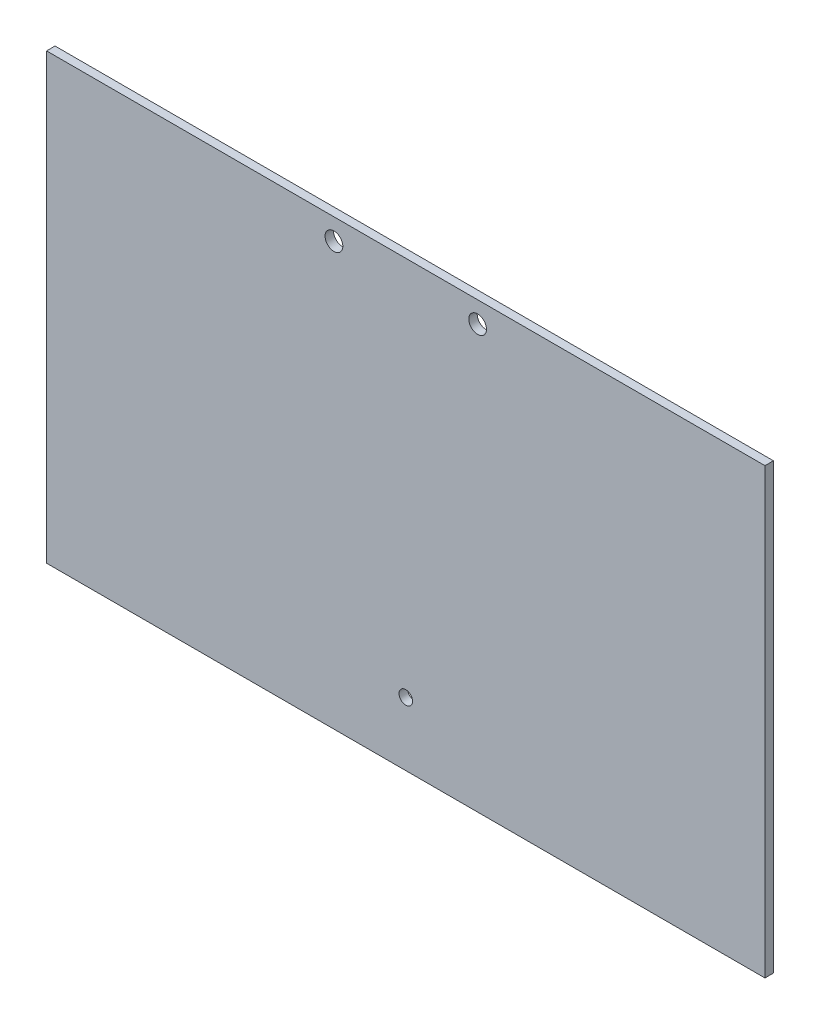
ISO-10303-21;
HEADER;
FILE_DESCRIPTION(('STEP AP214'),'2;1');
FILE_NAME('part.step','',(''),(''),'','','');
FILE_SCHEMA(('AUTOMOTIVE_DESIGN { 1 0 10303 214 1 1 1 1 }'));
ENDSEC;
DATA;
#1=APPLICATION_CONTEXT('core data for automotive mechanical design processes');
#2=APPLICATION_PROTOCOL_DEFINITION('international standard','automotive_design',2000,#1);
#3=PRODUCT_CONTEXT('',#1,'mechanical');
#4=PRODUCT('Part','Part','',(#3));
#5=PRODUCT_RELATED_PRODUCT_CATEGORY('part','',(#4));
#6=PRODUCT_DEFINITION_FORMATION('','',#4);
#7=PRODUCT_DEFINITION_CONTEXT('part definition',#1,'design');
#8=PRODUCT_DEFINITION('design','',#6,#7);
#9=PRODUCT_DEFINITION_SHAPE('','',#8);
#10=(LENGTH_UNIT() NAMED_UNIT(*) SI_UNIT(.MILLI.,.METRE.));
#11=(NAMED_UNIT(*) PLANE_ANGLE_UNIT() SI_UNIT($,.RADIAN.));
#12=(NAMED_UNIT(*) SI_UNIT($,.STERADIAN.) SOLID_ANGLE_UNIT());
#13=UNCERTAINTY_MEASURE_WITH_UNIT(LENGTH_MEASURE(1.E-05),#10,'distance_accuracy_value','');
#14=(GEOMETRIC_REPRESENTATION_CONTEXT(3) GLOBAL_UNCERTAINTY_ASSIGNED_CONTEXT((#13)) GLOBAL_UNIT_ASSIGNED_CONTEXT((#10,
#11,#12)) REPRESENTATION_CONTEXT('',''));
#15=CARTESIAN_POINT('',(0.,0.,0.));
#16=DIRECTION('',(0.,0.,1.));
#17=DIRECTION('',(1.,0.,0.));
#18=AXIS2_PLACEMENT_3D('',#15,#16,#17);
#19=CARTESIAN_POINT('',(85.,52.5,2.));
#20=DIRECTION('',(-1.,0.,0.));
#21=DIRECTION('',(0.,-1.,0.));
#22=AXIS2_PLACEMENT_3D('',#19,#20,#21);
#23=PLANE('',#22);
#24=DIRECTION('',(0.,1.,0.));
#25=VECTOR('',#24,1.);
#26=CARTESIAN_POINT('',(85.,52.5,0.));
#27=LINE('',#26,#25);
#28=CARTESIAN_POINT('',(85.,-52.5,0.));
#29=VERTEX_POINT('',#28);
#30=CARTESIAN_POINT('',(85.,52.5,0.));
#31=VERTEX_POINT('',#30);
#32=EDGE_CURVE('E96',#29,#31,#27,.T.);
#33=ORIENTED_EDGE('',*,*,#32,.T.);
#34=DIRECTION('',(0.,0.,-1.));
#35=VECTOR('',#34,1.);
#36=CARTESIAN_POINT('',(85.,52.5,2.));
#37=LINE('',#36,#35);
#38=CARTESIAN_POINT('',(85.,52.5,2.));
#39=VERTEX_POINT('',#38);
#40=EDGE_CURVE('E11',#39,#31,#37,.T.);
#41=ORIENTED_EDGE('',*,*,#40,.F.);
#42=DIRECTION('',(0.,1.,0.));
#43=VECTOR('',#42,1.);
#44=CARTESIAN_POINT('',(85.,52.5,2.));
#45=LINE('',#44,#43);
#46=CARTESIAN_POINT('',(85.,-52.5,2.));
#47=VERTEX_POINT('',#46);
#48=EDGE_CURVE('E84',#47,#39,#45,.T.);
#49=ORIENTED_EDGE('',*,*,#48,.F.);
#50=DIRECTION('',(0.,0.,-1.));
#51=VECTOR('',#50,1.);
#52=CARTESIAN_POINT('',(85.,-52.5,2.));
#53=LINE('',#52,#51);
#54=EDGE_CURVE('E92',#47,#29,#53,.T.);
#55=ORIENTED_EDGE('',*,*,#54,.T.);
#56=EDGE_LOOP('',(#33,#41,#49,#55));
#57=FACE_BOUND('',#56,.T.);
#58=ADVANCED_FACE('F33',(#57),#23,.F.);
#59=CARTESIAN_POINT('',(-85.,52.5,2.));
#60=DIRECTION('',(0.,-1.,0.));
#61=DIRECTION('',(0.,0.,-1.));
#62=AXIS2_PLACEMENT_3D('',#59,#60,#61);
#63=PLANE('',#62);
#64=DIRECTION('',(-1.,0.,0.));
#65=VECTOR('',#64,1.);
#66=CARTESIAN_POINT('',(-85.,52.5,0.));
#67=LINE('',#66,#65);
#68=CARTESIAN_POINT('',(-85.,52.5,0.));
#69=VERTEX_POINT('',#68);
#70=EDGE_CURVE('E88',#31,#69,#67,.T.);
#71=ORIENTED_EDGE('',*,*,#70,.T.);
#72=DIRECTION('',(0.,0.,-1.));
#73=VECTOR('',#72,1.);
#74=CARTESIAN_POINT('',(-85.,52.5,2.));
#75=LINE('',#74,#73);
#76=CARTESIAN_POINT('',(-85.,52.5,2.));
#77=VERTEX_POINT('',#76);
#78=EDGE_CURVE('E41',#77,#69,#75,.T.);
#79=ORIENTED_EDGE('',*,*,#78,.F.);
#80=DIRECTION('',(-1.,0.,0.));
#81=VECTOR('',#80,1.);
#82=CARTESIAN_POINT('',(-85.,52.5,2.));
#83=LINE('',#82,#81);
#84=EDGE_CURVE('E79',#39,#77,#83,.T.);
#85=ORIENTED_EDGE('',*,*,#84,.F.);
#86=ORIENTED_EDGE('',*,*,#40,.T.);
#87=EDGE_LOOP('',(#71,#79,#85,#86));
#88=FACE_BOUND('',#87,.T.);
#89=ADVANCED_FACE('F87',(#88),#63,.F.);
#90=CARTESIAN_POINT('',(-85.,52.5,2.));
#91=DIRECTION('',(1.,0.,0.));
#92=DIRECTION('',(0.,1.,0.));
#93=AXIS2_PLACEMENT_3D('',#90,#91,#92);
#94=PLANE('',#93);
#95=DIRECTION('',(0.,-1.,0.));
#96=VECTOR('',#95,1.);
#97=CARTESIAN_POINT('',(-85.,52.5,0.));
#98=LINE('',#97,#96);
#99=CARTESIAN_POINT('',(-85.,-52.5,0.));
#100=VERTEX_POINT('',#99);
#101=EDGE_CURVE('E66',#69,#100,#98,.T.);
#102=ORIENTED_EDGE('',*,*,#101,.T.);
#103=DIRECTION('',(0.,0.,-1.));
#104=VECTOR('',#103,1.);
#105=CARTESIAN_POINT('',(-85.,-52.5,2.));
#106=LINE('',#105,#104);
#107=CARTESIAN_POINT('',(-85.,-52.5,2.));
#108=VERTEX_POINT('',#107);
#109=EDGE_CURVE('E89',#108,#100,#106,.T.);
#110=ORIENTED_EDGE('',*,*,#109,.F.);
#111=DIRECTION('',(0.,-1.,0.));
#112=VECTOR('',#111,1.);
#113=CARTESIAN_POINT('',(-85.,52.5,2.));
#114=LINE('',#113,#112);
#115=EDGE_CURVE('E82',#77,#108,#114,.T.);
#116=ORIENTED_EDGE('',*,*,#115,.F.);
#117=ORIENTED_EDGE('',*,*,#78,.T.);
#118=EDGE_LOOP('',(#102,#110,#116,#117));
#119=FACE_BOUND('',#118,.T.);
#120=ADVANCED_FACE('F90',(#119),#94,.F.);
#121=CARTESIAN_POINT('',(-85.,-52.5,2.));
#122=DIRECTION('',(0.,1.,0.));
#123=DIRECTION('',(0.,0.,1.));
#124=AXIS2_PLACEMENT_3D('',#121,#122,#123);
#125=PLANE('',#124);
#126=DIRECTION('',(1.,0.,0.));
#127=VECTOR('',#126,1.);
#128=CARTESIAN_POINT('',(-85.,-52.5,0.));
#129=LINE('',#128,#127);
#130=EDGE_CURVE('E72',#100,#29,#129,.T.);
#131=ORIENTED_EDGE('',*,*,#130,.T.);
#132=ORIENTED_EDGE('',*,*,#54,.F.);
#133=DIRECTION('',(1.,0.,0.));
#134=VECTOR('',#133,1.);
#135=CARTESIAN_POINT('',(-85.,-52.5,2.));
#136=LINE('',#135,#134);
#137=EDGE_CURVE('E49',#108,#47,#136,.T.);
#138=ORIENTED_EDGE('',*,*,#137,.F.);
#139=ORIENTED_EDGE('',*,*,#109,.T.);
#140=EDGE_LOOP('',(#131,#132,#138,#139));
#141=FACE_BOUND('',#140,.T.);
#142=ADVANCED_FACE('F104',(#141),#125,.F.);
#143=CARTESIAN_POINT('',(0.,0.,2.));
#144=DIRECTION('',(0.,0.,1.));
#145=DIRECTION('',(1.,0.,0.));
#146=AXIS2_PLACEMENT_3D('',#143,#144,#145);
#147=PLANE('',#146);
#148=CARTESIAN_POINT('',(17.,47.5,2.));
#149=DIRECTION('',(0.,0.,1.));
#150=DIRECTION('',(1.,0.,0.));
#151=AXIS2_PLACEMENT_3D('',#148,#149,#150);
#152=CIRCLE('',#151,2.1);
#153=CARTESIAN_POINT('',(19.1,47.5,2.));
#154=VERTEX_POINT('',#153);
#155=EDGE_CURVE('E122',#154,#154,#152,.T.);
#156=ORIENTED_EDGE('',*,*,#155,.F.);
#157=EDGE_LOOP('',(#156));
#158=FACE_BOUND('',#157,.T.);
#159=CARTESIAN_POINT('',(-17.,47.5,2.));
#160=DIRECTION('',(0.,0.,1.));
#161=DIRECTION('',(1.,0.,0.));
#162=AXIS2_PLACEMENT_3D('',#159,#160,#161);
#163=CIRCLE('',#162,2.1);
#164=CARTESIAN_POINT('',(-14.9,47.5,2.));
#165=VERTEX_POINT('',#164);
#166=EDGE_CURVE('E116',#165,#165,#163,.T.);
#167=ORIENTED_EDGE('',*,*,#166,.F.);
#168=EDGE_LOOP('',(#167));
#169=FACE_BOUND('',#168,.T.);
#170=CARTESIAN_POINT('',(0.,-37.5,2.));
#171=DIRECTION('',(0.,0.,1.));
#172=DIRECTION('',(1.,0.,0.));
#173=AXIS2_PLACEMENT_3D('',#170,#171,#172);
#174=CIRCLE('',#173,1.6);
#175=CARTESIAN_POINT('',(1.6,-37.5,2.));
#176=VERTEX_POINT('',#175);
#177=EDGE_CURVE('E110',#176,#176,#174,.T.);
#178=ORIENTED_EDGE('',*,*,#177,.F.);
#179=EDGE_LOOP('',(#178));
#180=FACE_BOUND('',#179,.T.);
#181=ORIENTED_EDGE('',*,*,#48,.T.);
#182=ORIENTED_EDGE('',*,*,#84,.T.);
#183=ORIENTED_EDGE('',*,*,#115,.T.);
#184=ORIENTED_EDGE('',*,*,#137,.T.);
#185=EDGE_LOOP('',(#181,#182,#183,#184));
#186=FACE_BOUND('',#185,.T.);
#187=ADVANCED_FACE('F80',(#158,#169,#180,#186),#147,.T.);
#188=CARTESIAN_POINT('',(0.,0.,0.));
#189=DIRECTION('',(0.,0.,1.));
#190=DIRECTION('',(1.,0.,0.));
#191=AXIS2_PLACEMENT_3D('',#188,#189,#190);
#192=PLANE('',#191);
#193=CARTESIAN_POINT('',(17.,47.5,0.));
#194=DIRECTION('',(0.,0.,1.));
#195=DIRECTION('',(1.,0.,0.));
#196=AXIS2_PLACEMENT_3D('',#193,#194,#195);
#197=CIRCLE('',#196,2.1);
#198=CARTESIAN_POINT('',(19.1,47.5,0.));
#199=VERTEX_POINT('',#198);
#200=EDGE_CURVE('E99',#199,#199,#197,.T.);
#201=ORIENTED_EDGE('',*,*,#200,.T.);
#202=EDGE_LOOP('',(#201));
#203=FACE_BOUND('',#202,.T.);
#204=CARTESIAN_POINT('',(-17.,47.5,0.));
#205=DIRECTION('',(0.,0.,1.));
#206=DIRECTION('',(1.,0.,0.));
#207=AXIS2_PLACEMENT_3D('',#204,#205,#206);
#208=CIRCLE('',#207,2.1);
#209=CARTESIAN_POINT('',(-14.9,47.5,0.));
#210=VERTEX_POINT('',#209);
#211=EDGE_CURVE('E119',#210,#210,#208,.T.);
#212=ORIENTED_EDGE('',*,*,#211,.T.);
#213=EDGE_LOOP('',(#212));
#214=FACE_BOUND('',#213,.T.);
#215=CARTESIAN_POINT('',(0.,-37.5,0.));
#216=DIRECTION('',(0.,0.,1.));
#217=DIRECTION('',(1.,0.,0.));
#218=AXIS2_PLACEMENT_3D('',#215,#216,#217);
#219=CIRCLE('',#218,1.6);
#220=CARTESIAN_POINT('',(1.6,-37.5,0.));
#221=VERTEX_POINT('',#220);
#222=EDGE_CURVE('E113',#221,#221,#219,.T.);
#223=ORIENTED_EDGE('',*,*,#222,.T.);
#224=EDGE_LOOP('',(#223));
#225=FACE_BOUND('',#224,.T.);
#226=ORIENTED_EDGE('',*,*,#32,.F.);
#227=ORIENTED_EDGE('',*,*,#130,.F.);
#228=ORIENTED_EDGE('',*,*,#101,.F.);
#229=ORIENTED_EDGE('',*,*,#70,.F.);
#230=EDGE_LOOP('',(#226,#227,#228,#229));
#231=FACE_BOUND('',#230,.T.);
#232=ADVANCED_FACE('F107',(#203,#214,#225,#231),#192,.F.);
#233=CARTESIAN_POINT('',(0.,-37.5,0.));
#234=DIRECTION('',(0.,0.,1.));
#235=DIRECTION('',(1.,0.,0.));
#236=AXIS2_PLACEMENT_3D('',#233,#234,#235);
#237=CYLINDRICAL_SURFACE('',#236,1.6);
#238=ORIENTED_EDGE('',*,*,#222,.F.);
#239=EDGE_LOOP('',(#238));
#240=FACE_BOUND('',#239,.T.);
#241=ORIENTED_EDGE('',*,*,#177,.T.);
#242=EDGE_LOOP('',(#241));
#243=FACE_BOUND('',#242,.T.);
#244=ADVANCED_FACE('F144',(#240,#243),#237,.F.);
#245=CARTESIAN_POINT('',(-17.,47.5,0.));
#246=DIRECTION('',(0.,0.,1.));
#247=DIRECTION('',(1.,0.,0.));
#248=AXIS2_PLACEMENT_3D('',#245,#246,#247);
#249=CYLINDRICAL_SURFACE('',#248,2.1);
#250=ORIENTED_EDGE('',*,*,#211,.F.);
#251=EDGE_LOOP('',(#250));
#252=FACE_BOUND('',#251,.T.);
#253=ORIENTED_EDGE('',*,*,#166,.T.);
#254=EDGE_LOOP('',(#253));
#255=FACE_BOUND('',#254,.T.);
#256=ADVANCED_FACE('F133',(#252,#255),#249,.F.);
#257=CARTESIAN_POINT('',(17.,47.5,0.));
#258=DIRECTION('',(0.,0.,1.));
#259=DIRECTION('',(1.,0.,0.));
#260=AXIS2_PLACEMENT_3D('',#257,#258,#259);
#261=CYLINDRICAL_SURFACE('',#260,2.1);
#262=ORIENTED_EDGE('',*,*,#200,.F.);
#263=EDGE_LOOP('',(#262));
#264=FACE_BOUND('',#263,.T.);
#265=ORIENTED_EDGE('',*,*,#155,.T.);
#266=EDGE_LOOP('',(#265));
#267=FACE_BOUND('',#266,.T.);
#268=ADVANCED_FACE('F130',(#264,#267),#261,.F.);
#269=CLOSED_SHELL('',(#58,#89,#120,#142,#187,#232,#244,#256,#268));
#270=MANIFOLD_SOLID_BREP('B2',#269);
#271=ADVANCED_BREP_SHAPE_REPRESENTATION('',(#18,#270),#14);
#272=SHAPE_DEFINITION_REPRESENTATION(#9,#271);
ENDSEC;
END-ISO-10303-21;
